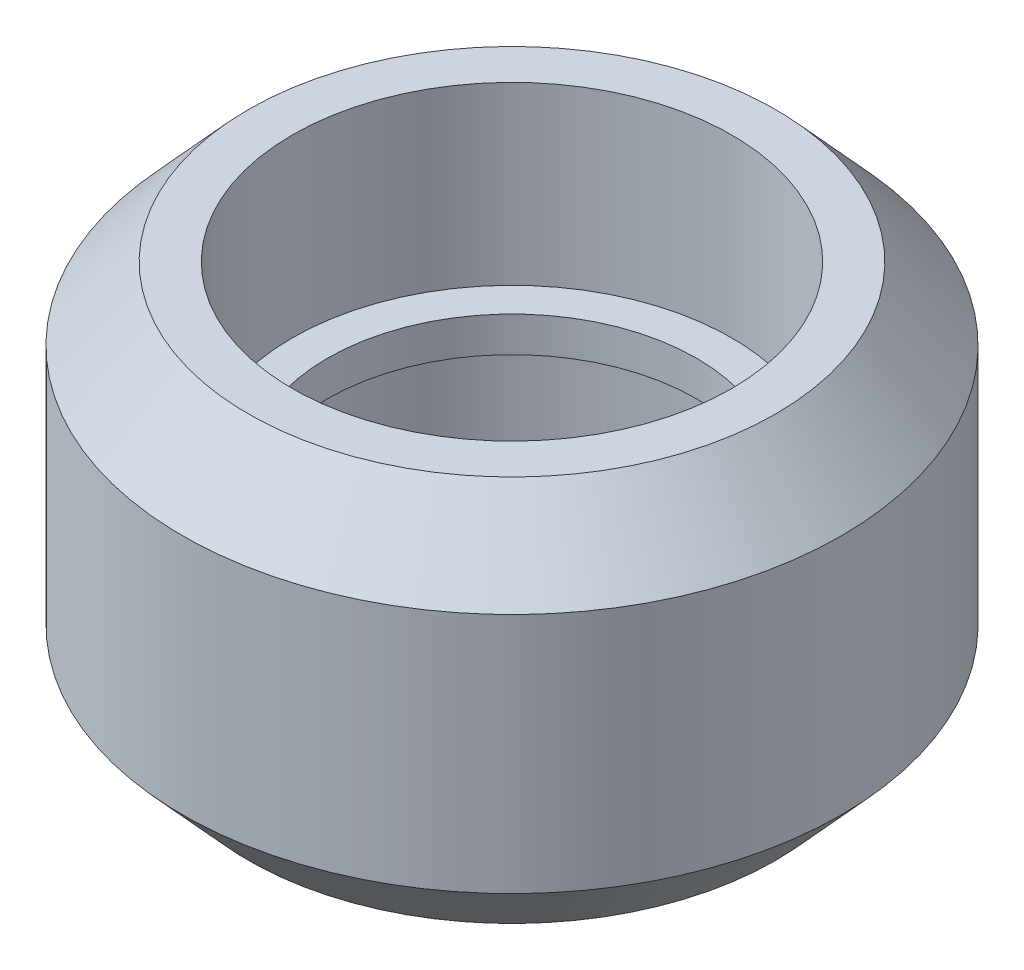
ISO-10303-21;
HEADER;
FILE_DESCRIPTION(('STEP AP214'),'2;1');
FILE_NAME('part.step','',(''),(''),'','','');
FILE_SCHEMA(('AUTOMOTIVE_DESIGN { 1 0 10303 214 1 1 1 1 }'));
ENDSEC;
DATA;
#1=APPLICATION_CONTEXT('core data for automotive mechanical design processes');
#2=APPLICATION_PROTOCOL_DEFINITION('international standard','automotive_design',2000,#1);
#3=PRODUCT_CONTEXT('',#1,'mechanical');
#4=PRODUCT('Part','Part','',(#3));
#5=PRODUCT_RELATED_PRODUCT_CATEGORY('part','',(#4));
#6=PRODUCT_DEFINITION_FORMATION('','',#4);
#7=PRODUCT_DEFINITION_CONTEXT('part definition',#1,'design');
#8=PRODUCT_DEFINITION('design','',#6,#7);
#9=PRODUCT_DEFINITION_SHAPE('','',#8);
#10=(LENGTH_UNIT() NAMED_UNIT(*) SI_UNIT(.MILLI.,.METRE.));
#11=(NAMED_UNIT(*) PLANE_ANGLE_UNIT() SI_UNIT($,.RADIAN.));
#12=(NAMED_UNIT(*) SI_UNIT($,.STERADIAN.) SOLID_ANGLE_UNIT());
#13=UNCERTAINTY_MEASURE_WITH_UNIT(LENGTH_MEASURE(1.E-05),#10,'distance_accuracy_value','');
#14=(GEOMETRIC_REPRESENTATION_CONTEXT(3) GLOBAL_UNCERTAINTY_ASSIGNED_CONTEXT((#13)) GLOBAL_UNIT_ASSIGNED_CONTEXT((#10,
#11,#12)) REPRESENTATION_CONTEXT('',''));
#15=CARTESIAN_POINT('',(0.,0.,0.));
#16=DIRECTION('',(0.,0.,1.));
#17=DIRECTION('',(1.,0.,0.));
#18=AXIS2_PLACEMENT_3D('',#15,#16,#17);
#19=CARTESIAN_POINT('',(-0.409005836379817,-0.0855887276785729,0.));
#20=DIRECTION('',(0.,1.,0.));
#21=DIRECTION('',(1.,0.,0.));
#22=AXIS2_PLACEMENT_3D('',#19,#20,#21);
#23=CONICAL_SURFACE('',#22,6.75,0.737815060120464);
#24=CARTESIAN_POINT('',(-0.409005836379817,-0.910588727678573,0.));
#25=DIRECTION('',(0.,-1.,0.));
#26=DIRECTION('',(1.,0.,0.));
#27=AXIS2_PLACEMENT_3D('',#24,#25,#26);
#28=CIRCLE('',#27,6.);
#29=CARTESIAN_POINT('',(5.59099416362018,-0.910588727678573,0.));
#30=VERTEX_POINT('',#29);
#31=CARTESIAN_POINT('',(-6.40900583637982,-0.910588727678573,0.));
#32=VERTEX_POINT('',#31);
#33=EDGE_CURVE('E41',#30,#32,#28,.T.);
#34=ORIENTED_EDGE('',*,*,#33,.F.);
#35=CARTESIAN_POINT('',(-0.409005836379817,-0.910588727678573,0.));
#36=DIRECTION('',(0.,-1.,0.));
#37=DIRECTION('',(1.,0.,0.));
#38=AXIS2_PLACEMENT_3D('',#35,#36,#37);
#39=CIRCLE('',#38,6.);
#40=EDGE_CURVE('E206',#32,#30,#39,.T.);
#41=ORIENTED_EDGE('',*,*,#40,.F.);
#42=DIRECTION('',(-0.672672793996312,0.739940073395944,0.));
#43=VECTOR('',#42,1.);
#44=CARTESIAN_POINT('',(-7.15900583637982,-0.0855887276785729,0.));
#45=LINE('',#44,#43);
#46=CARTESIAN_POINT('',(-7.90900583637982,0.739411272321427,0.));
#47=VERTEX_POINT('',#46);
#48=EDGE_CURVE('E10',#32,#47,#45,.T.);
#49=ORIENTED_EDGE('',*,*,#48,.T.);
#50=CARTESIAN_POINT('',(-0.409005836379817,0.739411272321427,0.));
#51=DIRECTION('',(0.,-1.,0.));
#52=DIRECTION('',(1.,0.,0.));
#53=AXIS2_PLACEMENT_3D('',#50,#51,#52);
#54=CIRCLE('',#53,7.5);
#55=CARTESIAN_POINT('',(7.09099416362018,0.739411272321427,0.));
#56=VERTEX_POINT('',#55);
#57=EDGE_CURVE('E27',#47,#56,#54,.T.);
#58=ORIENTED_EDGE('',*,*,#57,.T.);
#59=CARTESIAN_POINT('',(-0.409005836379817,0.739411272321427,0.));
#60=DIRECTION('',(0.,-1.,0.));
#61=DIRECTION('',(1.,0.,0.));
#62=AXIS2_PLACEMENT_3D('',#59,#60,#61);
#63=CIRCLE('',#62,7.5);
#64=EDGE_CURVE('E190',#56,#47,#63,.T.);
#65=ORIENTED_EDGE('',*,*,#64,.T.);
#66=ORIENTED_EDGE('',*,*,#48,.F.);
#67=EDGE_LOOP('',(#34,#41,#49,#58,#65,#66));
#68=FACE_BOUND('',#67,.T.);
#69=ADVANCED_FACE('F16',(#68),#23,.T.);
#70=CARTESIAN_POINT('',(4.59099416362018,-0.910588727678573,0.));
#71=DIRECTION('',(0.,-1.,0.));
#72=DIRECTION('',(0.,0.,-1.));
#73=AXIS2_PLACEMENT_3D('',#70,#71,#72);
#74=PLANE('',#73);
#75=ORIENTED_EDGE('',*,*,#33,.T.);
#76=ORIENTED_EDGE('',*,*,#40,.T.);
#77=EDGE_LOOP('',(#75,#76));
#78=FACE_BOUND('',#77,.T.);
#79=CARTESIAN_POINT('',(-0.409005836379817,-0.910588727678573,0.));
#80=DIRECTION('',(0.,-1.,0.));
#81=DIRECTION('',(1.,0.,0.));
#82=AXIS2_PLACEMENT_3D('',#79,#80,#81);
#83=CIRCLE('',#82,5.);
#84=CARTESIAN_POINT('',(4.59099416362018,-0.910588727678573,0.));
#85=VERTEX_POINT('',#84);
#86=CARTESIAN_POINT('',(-5.40900583637982,-0.910588727678573,0.));
#87=VERTEX_POINT('',#86);
#88=EDGE_CURVE('E203',#85,#87,#83,.T.);
#89=ORIENTED_EDGE('',*,*,#88,.F.);
#90=CARTESIAN_POINT('',(-0.409005836379817,-0.910588727678573,0.));
#91=DIRECTION('',(0.,-1.,0.));
#92=DIRECTION('',(1.,0.,0.));
#93=AXIS2_PLACEMENT_3D('',#90,#91,#92);
#94=CIRCLE('',#93,5.);
#95=EDGE_CURVE('E180',#87,#85,#94,.T.);
#96=ORIENTED_EDGE('',*,*,#95,.F.);
#97=EDGE_LOOP('',(#89,#96));
#98=FACE_BOUND('',#97,.T.);
#99=ADVANCED_FACE('F221',(#78,#98),#74,.T.);
#100=CARTESIAN_POINT('',(-0.409005836379817,1.08941127232143,0.));
#101=DIRECTION('',(0.,-1.,0.));
#102=DIRECTION('',(1.,0.,0.));
#103=AXIS2_PLACEMENT_3D('',#100,#101,#102);
#104=CYLINDRICAL_SURFACE('',#103,5.);
#105=ORIENTED_EDGE('',*,*,#88,.T.);
#106=DIRECTION('',(0.,1.,0.));
#107=VECTOR('',#106,1.);
#108=CARTESIAN_POINT('',(-5.40900583637982,1.08941127232143,0.));
#109=LINE('',#108,#107);
#110=CARTESIAN_POINT('',(-5.40900583637982,3.08941127232143,0.));
#111=VERTEX_POINT('',#110);
#112=EDGE_CURVE('E184',#87,#111,#109,.T.);
#113=ORIENTED_EDGE('',*,*,#112,.T.);
#114=CARTESIAN_POINT('',(-0.409005836379817,3.08941127232143,0.));
#115=DIRECTION('',(0.,-1.,0.));
#116=DIRECTION('',(1.,0.,0.));
#117=AXIS2_PLACEMENT_3D('',#114,#115,#116);
#118=CIRCLE('',#117,5.);
#119=CARTESIAN_POINT('',(4.59099416362018,3.08941127232143,0.));
#120=VERTEX_POINT('',#119);
#121=EDGE_CURVE('E185',#120,#111,#118,.T.);
#122=ORIENTED_EDGE('',*,*,#121,.F.);
#123=CARTESIAN_POINT('',(-0.409005836379817,3.08941127232143,0.));
#124=DIRECTION('',(0.,-1.,0.));
#125=DIRECTION('',(1.,0.,0.));
#126=AXIS2_PLACEMENT_3D('',#123,#124,#125);
#127=CIRCLE('',#126,5.);
#128=EDGE_CURVE('E152',#111,#120,#127,.T.);
#129=ORIENTED_EDGE('',*,*,#128,.F.);
#130=ORIENTED_EDGE('',*,*,#112,.F.);
#131=ORIENTED_EDGE('',*,*,#95,.T.);
#132=EDGE_LOOP('',(#105,#113,#122,#129,#130,#131));
#133=FACE_BOUND('',#132,.T.);
#134=ADVANCED_FACE('F224',(#133),#104,.F.);
#135=CARTESIAN_POINT('',(3.79099416362018,3.08941127232143,0.));
#136=DIRECTION('',(0.,-1.,0.));
#137=DIRECTION('',(0.,0.,-1.));
#138=AXIS2_PLACEMENT_3D('',#135,#136,#137);
#139=PLANE('',#138);
#140=ORIENTED_EDGE('',*,*,#121,.T.);
#141=ORIENTED_EDGE('',*,*,#128,.T.);
#142=EDGE_LOOP('',(#140,#141));
#143=FACE_BOUND('',#142,.T.);
#144=CARTESIAN_POINT('',(-0.409005836379817,3.08941127232143,0.));
#145=DIRECTION('',(0.,-1.,0.));
#146=DIRECTION('',(1.,0.,0.));
#147=AXIS2_PLACEMENT_3D('',#144,#145,#146);
#148=CIRCLE('',#147,4.2);
#149=CARTESIAN_POINT('',(3.79099416362018,3.08941127232143,0.));
#150=VERTEX_POINT('',#149);
#151=CARTESIAN_POINT('',(-4.60900583637982,3.08941127232143,0.));
#152=VERTEX_POINT('',#151);
#153=EDGE_CURVE('E149',#150,#152,#148,.T.);
#154=ORIENTED_EDGE('',*,*,#153,.F.);
#155=CARTESIAN_POINT('',(-0.409005836379817,3.08941127232143,0.));
#156=DIRECTION('',(0.,-1.,0.));
#157=DIRECTION('',(1.,0.,0.));
#158=AXIS2_PLACEMENT_3D('',#155,#156,#157);
#159=CIRCLE('',#158,4.2);
#160=EDGE_CURVE('E148',#152,#150,#159,.T.);
#161=ORIENTED_EDGE('',*,*,#160,.F.);
#162=EDGE_LOOP('',(#154,#161));
#163=FACE_BOUND('',#162,.T.);
#164=ADVANCED_FACE('F231',(#143,#163),#139,.T.);
#165=CARTESIAN_POINT('',(-0.409005836379817,3.48941127232143,0.));
#166=DIRECTION('',(0.,-1.,0.));
#167=DIRECTION('',(1.,0.,0.));
#168=AXIS2_PLACEMENT_3D('',#165,#166,#167);
#169=CYLINDRICAL_SURFACE('',#168,4.2);
#170=ORIENTED_EDGE('',*,*,#153,.T.);
#171=DIRECTION('',(0.,1.,0.));
#172=VECTOR('',#171,1.);
#173=CARTESIAN_POINT('',(-4.60900583637982,3.48941127232143,0.));
#174=LINE('',#173,#172);
#175=CARTESIAN_POINT('',(-4.60900583637982,3.88941127232143,0.));
#176=VERTEX_POINT('',#175);
#177=EDGE_CURVE('E153',#152,#176,#174,.T.);
#178=ORIENTED_EDGE('',*,*,#177,.T.);
#179=CARTESIAN_POINT('',(-0.409005836379817,3.88941127232143,0.));
#180=DIRECTION('',(0.,-1.,0.));
#181=DIRECTION('',(1.,0.,0.));
#182=AXIS2_PLACEMENT_3D('',#179,#180,#181);
#183=CIRCLE('',#182,4.2);
#184=CARTESIAN_POINT('',(3.79099416362018,3.88941127232143,0.));
#185=VERTEX_POINT('',#184);
#186=EDGE_CURVE('E157',#185,#176,#183,.T.);
#187=ORIENTED_EDGE('',*,*,#186,.F.);
#188=CARTESIAN_POINT('',(-0.409005836379817,3.88941127232143,0.));
#189=DIRECTION('',(0.,-1.,0.));
#190=DIRECTION('',(1.,0.,0.));
#191=AXIS2_PLACEMENT_3D('',#188,#189,#190);
#192=CIRCLE('',#191,4.2);
#193=EDGE_CURVE('E154',#176,#185,#192,.T.);
#194=ORIENTED_EDGE('',*,*,#193,.F.);
#195=ORIENTED_EDGE('',*,*,#177,.F.);
#196=ORIENTED_EDGE('',*,*,#160,.T.);
#197=EDGE_LOOP('',(#170,#178,#187,#194,#195,#196));
#198=FACE_BOUND('',#197,.T.);
#199=ADVANCED_FACE('F18',(#198),#169,.F.);
#200=CARTESIAN_POINT('',(4.59099416362018,3.88941127232143,0.));
#201=DIRECTION('',(0.,1.,0.));
#202=DIRECTION('',(1.,0.,0.));
#203=AXIS2_PLACEMENT_3D('',#200,#201,#202);
#204=PLANE('',#203);
#205=CARTESIAN_POINT('',(-0.409005836379817,3.88941127232143,0.));
#206=DIRECTION('',(0.,-1.,0.));
#207=DIRECTION('',(1.,0.,0.));
#208=AXIS2_PLACEMENT_3D('',#205,#206,#207);
#209=CIRCLE('',#208,5.);
#210=CARTESIAN_POINT('',(4.59099416362018,3.88941127232143,0.));
#211=VERTEX_POINT('',#210);
#212=CARTESIAN_POINT('',(-5.40900583637982,3.88941127232143,0.));
#213=VERTEX_POINT('',#212);
#214=EDGE_CURVE('E158',#211,#213,#209,.T.);
#215=ORIENTED_EDGE('',*,*,#214,.F.);
#216=CARTESIAN_POINT('',(-0.409005836379817,3.88941127232143,0.));
#217=DIRECTION('',(0.,-1.,0.));
#218=DIRECTION('',(1.,0.,0.));
#219=AXIS2_PLACEMENT_3D('',#216,#217,#218);
#220=CIRCLE('',#219,5.);
#221=EDGE_CURVE('E177',#213,#211,#220,.T.);
#222=ORIENTED_EDGE('',*,*,#221,.F.);
#223=EDGE_LOOP('',(#215,#222));
#224=FACE_BOUND('',#223,.T.);
#225=ORIENTED_EDGE('',*,*,#186,.T.);
#226=ORIENTED_EDGE('',*,*,#193,.T.);
#227=EDGE_LOOP('',(#225,#226));
#228=FACE_BOUND('',#227,.T.);
#229=ADVANCED_FACE('F313',(#224,#228),#204,.T.);
#230=CARTESIAN_POINT('',(-0.409005836379817,5.88941127232143,0.));
#231=DIRECTION('',(0.,-1.,0.));
#232=DIRECTION('',(1.,0.,0.));
#233=AXIS2_PLACEMENT_3D('',#230,#231,#232);
#234=CYLINDRICAL_SURFACE('',#233,5.);
#235=ORIENTED_EDGE('',*,*,#214,.T.);
#236=DIRECTION('',(0.,1.,0.));
#237=VECTOR('',#236,1.);
#238=CARTESIAN_POINT('',(-5.40900583637982,5.88941127232143,0.));
#239=LINE('',#238,#237);
#240=CARTESIAN_POINT('',(-5.40900583637982,7.88941127232143,0.));
#241=VERTEX_POINT('',#240);
#242=EDGE_CURVE('E168',#213,#241,#239,.T.);
#243=ORIENTED_EDGE('',*,*,#242,.T.);
#244=CARTESIAN_POINT('',(-0.409005836379817,7.88941127232143,0.));
#245=DIRECTION('',(0.,-1.,0.));
#246=DIRECTION('',(1.,0.,0.));
#247=AXIS2_PLACEMENT_3D('',#244,#245,#246);
#248=CIRCLE('',#247,5.);
#249=CARTESIAN_POINT('',(4.59099416362018,7.88941127232143,0.));
#250=VERTEX_POINT('',#249);
#251=EDGE_CURVE('E189',#250,#241,#248,.T.);
#252=ORIENTED_EDGE('',*,*,#251,.F.);
#253=CARTESIAN_POINT('',(-0.409005836379817,7.88941127232143,0.));
#254=DIRECTION('',(0.,-1.,0.));
#255=DIRECTION('',(1.,0.,0.));
#256=AXIS2_PLACEMENT_3D('',#253,#254,#255);
#257=CIRCLE('',#256,5.);
#258=EDGE_CURVE('E136',#241,#250,#257,.T.);
#259=ORIENTED_EDGE('',*,*,#258,.F.);
#260=ORIENTED_EDGE('',*,*,#242,.F.);
#261=ORIENTED_EDGE('',*,*,#221,.T.);
#262=EDGE_LOOP('',(#235,#243,#252,#259,#260,#261));
#263=FACE_BOUND('',#262,.T.);
#264=ADVANCED_FACE('F306',(#263),#234,.F.);
#265=CARTESIAN_POINT('',(5.59099416362018,7.88941127232143,0.));
#266=DIRECTION('',(0.,1.,0.));
#267=DIRECTION('',(1.,0.,0.));
#268=AXIS2_PLACEMENT_3D('',#265,#266,#267);
#269=PLANE('',#268);
#270=CARTESIAN_POINT('',(-0.409005836379817,7.88941127232143,0.));
#271=DIRECTION('',(0.,-1.,0.));
#272=DIRECTION('',(1.,0.,0.));
#273=AXIS2_PLACEMENT_3D('',#270,#271,#272);
#274=CIRCLE('',#273,6.);
#275=CARTESIAN_POINT('',(5.59099416362018,7.88941127232143,0.));
#276=VERTEX_POINT('',#275);
#277=CARTESIAN_POINT('',(-6.40900583637982,7.88941127232143,0.));
#278=VERTEX_POINT('',#277);
#279=EDGE_CURVE('E133',#276,#278,#274,.T.);
#280=ORIENTED_EDGE('',*,*,#279,.F.);
#281=CARTESIAN_POINT('',(-0.409005836379817,7.88941127232143,0.));
#282=DIRECTION('',(0.,-1.,0.));
#283=DIRECTION('',(1.,0.,0.));
#284=AXIS2_PLACEMENT_3D('',#281,#282,#283);
#285=CIRCLE('',#284,6.);
#286=EDGE_CURVE('E20',#278,#276,#285,.T.);
#287=ORIENTED_EDGE('',*,*,#286,.F.);
#288=EDGE_LOOP('',(#280,#287));
#289=FACE_BOUND('',#288,.T.);
#290=ORIENTED_EDGE('',*,*,#251,.T.);
#291=ORIENTED_EDGE('',*,*,#258,.T.);
#292=EDGE_LOOP('',(#290,#291));
#293=FACE_BOUND('',#292,.T.);
#294=ADVANCED_FACE('F312',(#289,#293),#269,.T.);
#295=CARTESIAN_POINT('',(-0.409005836379817,7.06441127232143,0.));
#296=DIRECTION('',(0.,-1.,0.));
#297=DIRECTION('',(1.,0.,0.));
#298=AXIS2_PLACEMENT_3D('',#295,#296,#297);
#299=CONICAL_SURFACE('',#298,6.75,0.737815060120465);
#300=CARTESIAN_POINT('',(-0.409005836379817,6.23941127232143,0.));
#301=DIRECTION('',(0.,-1.,0.));
#302=DIRECTION('',(1.,0.,0.));
#303=AXIS2_PLACEMENT_3D('',#300,#301,#302);
#304=CIRCLE('',#303,7.5);
#305=CARTESIAN_POINT('',(7.09099416362018,6.23941127232143,0.));
#306=VERTEX_POINT('',#305);
#307=CARTESIAN_POINT('',(-7.90900583637982,6.23941127232143,0.));
#308=VERTEX_POINT('',#307);
#309=EDGE_CURVE('E113',#306,#308,#304,.T.);
#310=ORIENTED_EDGE('',*,*,#309,.F.);
#311=CARTESIAN_POINT('',(-0.409005836379817,6.23941127232143,0.));
#312=DIRECTION('',(0.,-1.,0.));
#313=DIRECTION('',(1.,0.,0.));
#314=AXIS2_PLACEMENT_3D('',#311,#312,#313);
#315=CIRCLE('',#314,7.5);
#316=EDGE_CURVE('E124',#308,#306,#315,.T.);
#317=ORIENTED_EDGE('',*,*,#316,.F.);
#318=DIRECTION('',(0.672672793996312,0.739940073395944,0.));
#319=VECTOR('',#318,1.);
#320=CARTESIAN_POINT('',(-7.15900583637982,7.06441127232143,0.));
#321=LINE('',#320,#319);
#322=EDGE_CURVE('E130',#308,#278,#321,.T.);
#323=ORIENTED_EDGE('',*,*,#322,.T.);
#324=ORIENTED_EDGE('',*,*,#286,.T.);
#325=ORIENTED_EDGE('',*,*,#279,.T.);
#326=ORIENTED_EDGE('',*,*,#322,.F.);
#327=EDGE_LOOP('',(#310,#317,#323,#324,#325,#326));
#328=FACE_BOUND('',#327,.T.);
#329=ADVANCED_FACE('F128',(#328),#299,.T.);
#330=CARTESIAN_POINT('',(-0.409005836379817,3.48941127232143,0.));
#331=DIRECTION('',(0.,-1.,0.));
#332=DIRECTION('',(1.,0.,0.));
#333=AXIS2_PLACEMENT_3D('',#330,#331,#332);
#334=CYLINDRICAL_SURFACE('',#333,7.5);
#335=ORIENTED_EDGE('',*,*,#64,.F.);
#336=ORIENTED_EDGE('',*,*,#57,.F.);
#337=DIRECTION('',(0.,1.,0.));
#338=VECTOR('',#337,1.);
#339=CARTESIAN_POINT('',(-7.90900583637982,3.48941127232143,0.));
#340=LINE('',#339,#338);
#341=EDGE_CURVE('E123',#47,#308,#340,.T.);
#342=ORIENTED_EDGE('',*,*,#341,.T.);
#343=ORIENTED_EDGE('',*,*,#316,.T.);
#344=ORIENTED_EDGE('',*,*,#309,.T.);
#345=ORIENTED_EDGE('',*,*,#341,.F.);
#346=EDGE_LOOP('',(#335,#336,#342,#343,#344,#345));
#347=FACE_BOUND('',#346,.T.);
#348=ADVANCED_FACE('F121',(#347),#334,.T.);
#349=CLOSED_SHELL('',(#69,#99,#134,#164,#199,#229,#264,#294,#329,#348));
#350=MANIFOLD_SOLID_BREP('B1',#349);
#351=ADVANCED_BREP_SHAPE_REPRESENTATION('',(#18,#350),#14);
#352=SHAPE_DEFINITION_REPRESENTATION(#9,#351);
ENDSEC;
END-ISO-10303-21;
